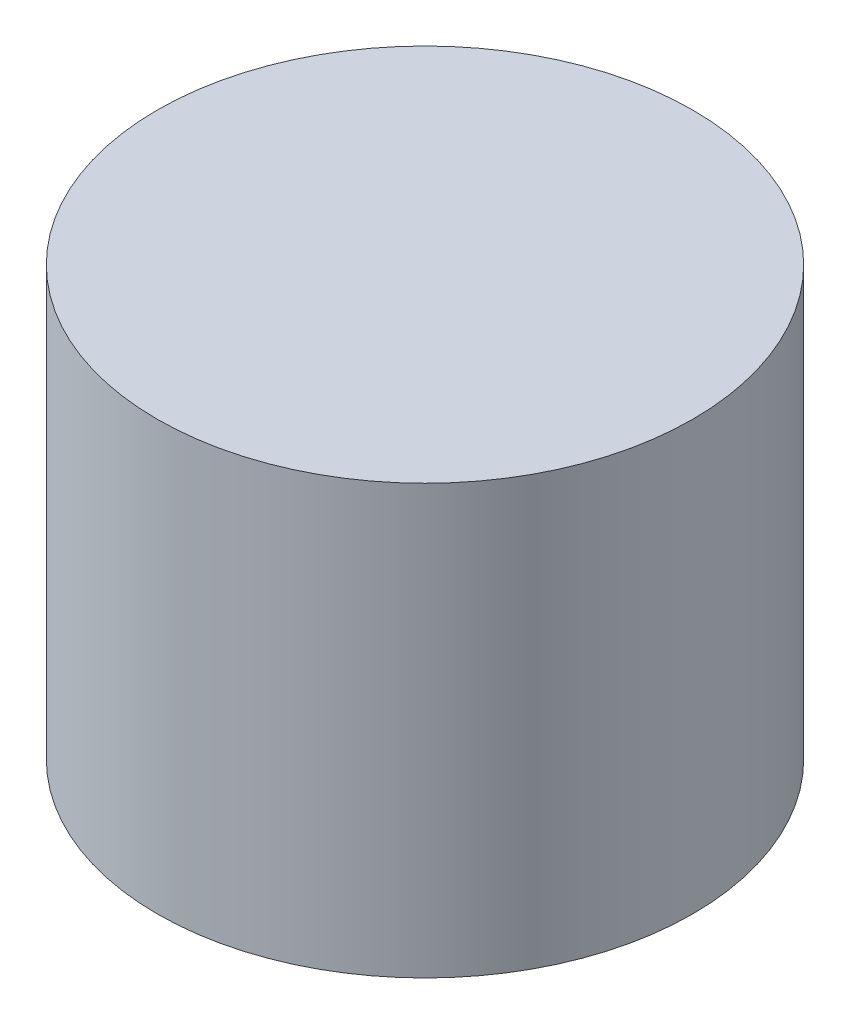
ISO-10303-21;
HEADER;
FILE_DESCRIPTION(('STEP AP214'),'2;1');
FILE_NAME('part.step','',(''),(''),'','','');
FILE_SCHEMA(('AUTOMOTIVE_DESIGN { 1 0 10303 214 1 1 1 1 }'));
ENDSEC;
DATA;
#1=APPLICATION_CONTEXT('core data for automotive mechanical design processes');
#2=APPLICATION_PROTOCOL_DEFINITION('international standard','automotive_design',2000,#1);
#3=PRODUCT_CONTEXT('',#1,'mechanical');
#4=PRODUCT('Part','Part','',(#3));
#5=PRODUCT_RELATED_PRODUCT_CATEGORY('part','',(#4));
#6=PRODUCT_DEFINITION_FORMATION('','',#4);
#7=PRODUCT_DEFINITION_CONTEXT('part definition',#1,'design');
#8=PRODUCT_DEFINITION('design','',#6,#7);
#9=PRODUCT_DEFINITION_SHAPE('','',#8);
#10=(LENGTH_UNIT() NAMED_UNIT(*) SI_UNIT(.MILLI.,.METRE.));
#11=(NAMED_UNIT(*) PLANE_ANGLE_UNIT() SI_UNIT($,.RADIAN.));
#12=(NAMED_UNIT(*) SI_UNIT($,.STERADIAN.) SOLID_ANGLE_UNIT());
#13=UNCERTAINTY_MEASURE_WITH_UNIT(LENGTH_MEASURE(1.E-05),#10,'distance_accuracy_value','');
#14=(GEOMETRIC_REPRESENTATION_CONTEXT(3) GLOBAL_UNCERTAINTY_ASSIGNED_CONTEXT((#13)) GLOBAL_UNIT_ASSIGNED_CONTEXT((#10,
#11,#12)) REPRESENTATION_CONTEXT('',''));
#15=CARTESIAN_POINT('',(0.,0.,0.));
#16=DIRECTION('',(0.,0.,1.));
#17=DIRECTION('',(1.,0.,0.));
#18=AXIS2_PLACEMENT_3D('',#15,#16,#17);
#19=CARTESIAN_POINT('',(0.,20.,0.));
#20=DIRECTION('',(0.,-1.,0.));
#21=DIRECTION('',(0.,0.,-1.));
#22=AXIS2_PLACEMENT_3D('',#19,#20,#21);
#23=CYLINDRICAL_SURFACE('',#22,12.5);
#24=CARTESIAN_POINT('',(0.,20.,0.));
#25=DIRECTION('',(0.,1.,0.));
#26=DIRECTION('',(0.,0.,1.));
#27=AXIS2_PLACEMENT_3D('',#24,#25,#26);
#28=CIRCLE('',#27,12.5);
#29=CARTESIAN_POINT('',(0.,20.,12.5));
#30=VERTEX_POINT('',#29);
#31=EDGE_CURVE('E10',#30,#30,#28,.T.);
#32=ORIENTED_EDGE('',*,*,#31,.F.);
#33=EDGE_LOOP('',(#32));
#34=FACE_BOUND('',#33,.T.);
#35=CARTESIAN_POINT('',(0.,0.,0.));
#36=DIRECTION('',(0.,1.,0.));
#37=DIRECTION('',(0.,0.,1.));
#38=AXIS2_PLACEMENT_3D('',#35,#36,#37);
#39=CIRCLE('',#38,12.5);
#40=CARTESIAN_POINT('',(0.,0.,12.5));
#41=VERTEX_POINT('',#40);
#42=EDGE_CURVE('E34',#41,#41,#39,.T.);
#43=ORIENTED_EDGE('',*,*,#42,.T.);
#44=EDGE_LOOP('',(#43));
#45=FACE_BOUND('',#44,.T.);
#46=ADVANCED_FACE('F31',(#34,#45),#23,.T.);
#47=CARTESIAN_POINT('',(0.,20.,0.));
#48=DIRECTION('',(0.,1.,0.));
#49=DIRECTION('',(0.,0.,1.));
#50=AXIS2_PLACEMENT_3D('',#47,#48,#49);
#51=PLANE('',#50);
#52=ORIENTED_EDGE('',*,*,#31,.T.);
#53=EDGE_LOOP('',(#52));
#54=FACE_BOUND('',#53,.T.);
#55=ADVANCED_FACE('F46',(#54),#51,.T.);
#56=CARTESIAN_POINT('',(0.,0.,0.));
#57=DIRECTION('',(0.,1.,0.));
#58=DIRECTION('',(0.,0.,1.));
#59=AXIS2_PLACEMENT_3D('',#56,#57,#58);
#60=PLANE('',#59);
#61=ORIENTED_EDGE('',*,*,#42,.F.);
#62=EDGE_LOOP('',(#61));
#63=FACE_BOUND('',#62,.T.);
#64=ADVANCED_FACE('F44',(#63),#60,.F.);
#65=CLOSED_SHELL('',(#46,#55,#64));
#66=MANIFOLD_SOLID_BREP('B2',#65);
#67=ADVANCED_BREP_SHAPE_REPRESENTATION('',(#18,#66),#14);
#68=SHAPE_DEFINITION_REPRESENTATION(#9,#67);
ENDSEC;
END-ISO-10303-21;
